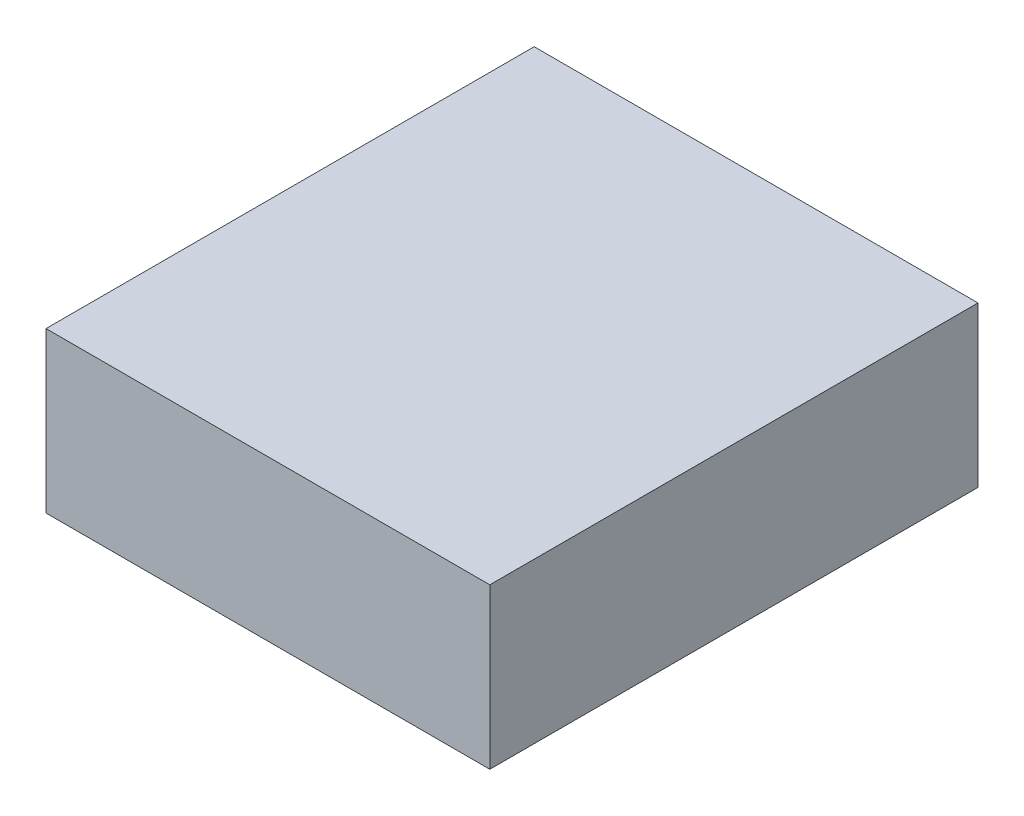
ISO-10303-21;
HEADER;
FILE_DESCRIPTION(('STEP AP214'),'2;1');
FILE_NAME('part.step','',(''),(''),'','','');
FILE_SCHEMA(('AUTOMOTIVE_DESIGN { 1 0 10303 214 1 1 1 1 }'));
ENDSEC;
DATA;
#1=APPLICATION_CONTEXT('core data for automotive mechanical design processes');
#2=APPLICATION_PROTOCOL_DEFINITION('international standard','automotive_design',2000,#1);
#3=PRODUCT_CONTEXT('',#1,'mechanical');
#4=PRODUCT('Part','Part','',(#3));
#5=PRODUCT_RELATED_PRODUCT_CATEGORY('part','',(#4));
#6=PRODUCT_DEFINITION_FORMATION('','',#4);
#7=PRODUCT_DEFINITION_CONTEXT('part definition',#1,'design');
#8=PRODUCT_DEFINITION('design','',#6,#7);
#9=PRODUCT_DEFINITION_SHAPE('','',#8);
#10=(LENGTH_UNIT() NAMED_UNIT(*) SI_UNIT(.MILLI.,.METRE.));
#11=(NAMED_UNIT(*) PLANE_ANGLE_UNIT() SI_UNIT($,.RADIAN.));
#12=(NAMED_UNIT(*) SI_UNIT($,.STERADIAN.) SOLID_ANGLE_UNIT());
#13=UNCERTAINTY_MEASURE_WITH_UNIT(LENGTH_MEASURE(1.E-05),#10,'distance_accuracy_value','');
#14=(GEOMETRIC_REPRESENTATION_CONTEXT(3) GLOBAL_UNCERTAINTY_ASSIGNED_CONTEXT((#13)) GLOBAL_UNIT_ASSIGNED_CONTEXT((#10,
#11,#12)) REPRESENTATION_CONTEXT('',''));
#15=CARTESIAN_POINT('',(0.,0.,0.));
#16=DIRECTION('',(0.,0.,1.));
#17=DIRECTION('',(1.,0.,0.));
#18=AXIS2_PLACEMENT_3D('',#15,#16,#17);
#19=CARTESIAN_POINT('',(12500.,4500.,13750.));
#20=DIRECTION('',(-1.,0.,0.));
#21=DIRECTION('',(0.,0.,1.));
#22=AXIS2_PLACEMENT_3D('',#19,#20,#21);
#23=PLANE('',#22);
#24=DIRECTION('',(0.,0.,-1.));
#25=VECTOR('',#24,1.);
#26=CARTESIAN_POINT('',(12500.,-4500.,13750.));
#27=LINE('',#26,#25);
#28=CARTESIAN_POINT('',(12500.,-4500.,13750.));
#29=VERTEX_POINT('',#28);
#30=CARTESIAN_POINT('',(12500.,-4500.,-13750.));
#31=VERTEX_POINT('',#30);
#32=EDGE_CURVE('E100',#29,#31,#27,.T.);
#33=ORIENTED_EDGE('',*,*,#32,.T.);
#34=DIRECTION('',(0.,-1.,0.));
#35=VECTOR('',#34,1.);
#36=CARTESIAN_POINT('',(12500.,4500.,-13750.));
#37=LINE('',#36,#35);
#38=CARTESIAN_POINT('',(12500.,4500.,-13750.));
#39=VERTEX_POINT('',#38);
#40=EDGE_CURVE('E11',#39,#31,#37,.T.);
#41=ORIENTED_EDGE('',*,*,#40,.F.);
#42=DIRECTION('',(0.,0.,-1.));
#43=VECTOR('',#42,1.);
#44=CARTESIAN_POINT('',(12500.,4500.,13750.));
#45=LINE('',#44,#43);
#46=CARTESIAN_POINT('',(12500.,4500.,13750.));
#47=VERTEX_POINT('',#46);
#48=EDGE_CURVE('E88',#47,#39,#45,.T.);
#49=ORIENTED_EDGE('',*,*,#48,.F.);
#50=DIRECTION('',(0.,-1.,0.));
#51=VECTOR('',#50,1.);
#52=CARTESIAN_POINT('',(12500.,4500.,13750.));
#53=LINE('',#52,#51);
#54=EDGE_CURVE('E96',#47,#29,#53,.T.);
#55=ORIENTED_EDGE('',*,*,#54,.T.);
#56=EDGE_LOOP('',(#33,#41,#49,#55));
#57=FACE_BOUND('',#56,.T.);
#58=ADVANCED_FACE('F37',(#57),#23,.F.);
#59=CARTESIAN_POINT('',(-12500.,4500.,-13750.));
#60=DIRECTION('',(0.,0.,1.));
#61=DIRECTION('',(1.,0.,0.));
#62=AXIS2_PLACEMENT_3D('',#59,#60,#61);
#63=PLANE('',#62);
#64=DIRECTION('',(-1.,0.,0.));
#65=VECTOR('',#64,1.);
#66=CARTESIAN_POINT('',(-12500.,-4500.,-13750.));
#67=LINE('',#66,#65);
#68=CARTESIAN_POINT('',(-12500.,-4500.,-13750.));
#69=VERTEX_POINT('',#68);
#70=EDGE_CURVE('E92',#31,#69,#67,.T.);
#71=ORIENTED_EDGE('',*,*,#70,.T.);
#72=DIRECTION('',(0.,-1.,0.));
#73=VECTOR('',#72,1.);
#74=CARTESIAN_POINT('',(-12500.,4500.,-13750.));
#75=LINE('',#74,#73);
#76=CARTESIAN_POINT('',(-12500.,4500.,-13750.));
#77=VERTEX_POINT('',#76);
#78=EDGE_CURVE('E45',#77,#69,#75,.T.);
#79=ORIENTED_EDGE('',*,*,#78,.F.);
#80=DIRECTION('',(-1.,0.,0.));
#81=VECTOR('',#80,1.);
#82=CARTESIAN_POINT('',(-12500.,4500.,-13750.));
#83=LINE('',#82,#81);
#84=EDGE_CURVE('E83',#39,#77,#83,.T.);
#85=ORIENTED_EDGE('',*,*,#84,.F.);
#86=ORIENTED_EDGE('',*,*,#40,.T.);
#87=EDGE_LOOP('',(#71,#79,#85,#86));
#88=FACE_BOUND('',#87,.T.);
#89=ADVANCED_FACE('F91',(#88),#63,.F.);
#90=CARTESIAN_POINT('',(-12500.,4500.,13750.));
#91=DIRECTION('',(1.,0.,0.));
#92=DIRECTION('',(0.,0.,-1.));
#93=AXIS2_PLACEMENT_3D('',#90,#91,#92);
#94=PLANE('',#93);
#95=DIRECTION('',(0.,0.,1.));
#96=VECTOR('',#95,1.);
#97=CARTESIAN_POINT('',(-12500.,-4500.,13750.));
#98=LINE('',#97,#96);
#99=CARTESIAN_POINT('',(-12500.,-4500.,13750.));
#100=VERTEX_POINT('',#99);
#101=EDGE_CURVE('E70',#69,#100,#98,.T.);
#102=ORIENTED_EDGE('',*,*,#101,.T.);
#103=DIRECTION('',(0.,-1.,0.));
#104=VECTOR('',#103,1.);
#105=CARTESIAN_POINT('',(-12500.,4500.,13750.));
#106=LINE('',#105,#104);
#107=CARTESIAN_POINT('',(-12500.,4500.,13750.));
#108=VERTEX_POINT('',#107);
#109=EDGE_CURVE('E93',#108,#100,#106,.T.);
#110=ORIENTED_EDGE('',*,*,#109,.F.);
#111=DIRECTION('',(0.,0.,1.));
#112=VECTOR('',#111,1.);
#113=CARTESIAN_POINT('',(-12500.,4500.,13750.));
#114=LINE('',#113,#112);
#115=EDGE_CURVE('E86',#77,#108,#114,.T.);
#116=ORIENTED_EDGE('',*,*,#115,.F.);
#117=ORIENTED_EDGE('',*,*,#78,.T.);
#118=EDGE_LOOP('',(#102,#110,#116,#117));
#119=FACE_BOUND('',#118,.T.);
#120=ADVANCED_FACE('F94',(#119),#94,.F.);
#121=CARTESIAN_POINT('',(-12500.,4500.,13750.));
#122=DIRECTION('',(0.,0.,-1.));
#123=DIRECTION('',(-1.,0.,0.));
#124=AXIS2_PLACEMENT_3D('',#121,#122,#123);
#125=PLANE('',#124);
#126=DIRECTION('',(1.,0.,0.));
#127=VECTOR('',#126,1.);
#128=CARTESIAN_POINT('',(-12500.,-4500.,13750.));
#129=LINE('',#128,#127);
#130=EDGE_CURVE('E76',#100,#29,#129,.T.);
#131=ORIENTED_EDGE('',*,*,#130,.T.);
#132=ORIENTED_EDGE('',*,*,#54,.F.);
#133=DIRECTION('',(1.,0.,0.));
#134=VECTOR('',#133,1.);
#135=CARTESIAN_POINT('',(-12500.,4500.,13750.));
#136=LINE('',#135,#134);
#137=EDGE_CURVE('E53',#108,#47,#136,.T.);
#138=ORIENTED_EDGE('',*,*,#137,.F.);
#139=ORIENTED_EDGE('',*,*,#109,.T.);
#140=EDGE_LOOP('',(#131,#132,#138,#139));
#141=FACE_BOUND('',#140,.T.);
#142=ADVANCED_FACE('F107',(#141),#125,.F.);
#143=CARTESIAN_POINT('',(0.,4500.,0.));
#144=DIRECTION('',(0.,-1.,0.));
#145=DIRECTION('',(0.,0.,-1.));
#146=AXIS2_PLACEMENT_3D('',#143,#144,#145);
#147=PLANE('',#146);
#148=ORIENTED_EDGE('',*,*,#48,.T.);
#149=ORIENTED_EDGE('',*,*,#84,.T.);
#150=ORIENTED_EDGE('',*,*,#115,.T.);
#151=ORIENTED_EDGE('',*,*,#137,.T.);
#152=EDGE_LOOP('',(#148,#149,#150,#151));
#153=FACE_BOUND('',#152,.T.);
#154=ADVANCED_FACE('F84',(#153),#147,.F.);
#155=CARTESIAN_POINT('',(0.,-4500.,0.));
#156=DIRECTION('',(0.,-1.,0.));
#157=DIRECTION('',(0.,0.,-1.));
#158=AXIS2_PLACEMENT_3D('',#155,#156,#157);
#159=PLANE('',#158);
#160=ORIENTED_EDGE('',*,*,#32,.F.);
#161=ORIENTED_EDGE('',*,*,#130,.F.);
#162=ORIENTED_EDGE('',*,*,#101,.F.);
#163=ORIENTED_EDGE('',*,*,#70,.F.);
#164=EDGE_LOOP('',(#160,#161,#162,#163));
#165=FACE_BOUND('',#164,.T.);
#166=ADVANCED_FACE('F110',(#165),#159,.T.);
#167=CLOSED_SHELL('',(#58,#89,#120,#142,#154,#166));
#168=MANIFOLD_SOLID_BREP('B2',#167);
#169=ADVANCED_BREP_SHAPE_REPRESENTATION('',(#18,#168),#14);
#170=SHAPE_DEFINITION_REPRESENTATION(#9,#169);
ENDSEC;
END-ISO-10303-21;
